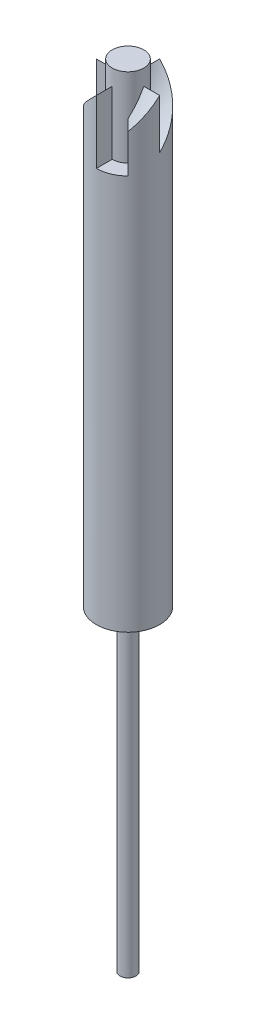
ISO-10303-21;
HEADER;
FILE_DESCRIPTION(('STEP AP214'),'2;1');
FILE_NAME('part.step','',(''),(''),'','','');
FILE_SCHEMA(('AUTOMOTIVE_DESIGN { 1 0 10303 214 1 1 1 1 }'));
ENDSEC;
DATA;
#1=APPLICATION_CONTEXT('core data for automotive mechanical design processes');
#2=APPLICATION_PROTOCOL_DEFINITION('international standard','automotive_design',2000,#1);
#3=PRODUCT_CONTEXT('',#1,'mechanical');
#4=PRODUCT('Part','Part','',(#3));
#5=PRODUCT_RELATED_PRODUCT_CATEGORY('part','',(#4));
#6=PRODUCT_DEFINITION_FORMATION('','',#4);
#7=PRODUCT_DEFINITION_CONTEXT('part definition',#1,'design');
#8=PRODUCT_DEFINITION('design','',#6,#7);
#9=PRODUCT_DEFINITION_SHAPE('','',#8);
#10=(LENGTH_UNIT() NAMED_UNIT(*) SI_UNIT(.MILLI.,.METRE.));
#11=(NAMED_UNIT(*) PLANE_ANGLE_UNIT() SI_UNIT($,.RADIAN.));
#12=(NAMED_UNIT(*) SI_UNIT($,.STERADIAN.) SOLID_ANGLE_UNIT());
#13=UNCERTAINTY_MEASURE_WITH_UNIT(LENGTH_MEASURE(1.E-05),#10,'distance_accuracy_value','');
#14=(GEOMETRIC_REPRESENTATION_CONTEXT(3) GLOBAL_UNCERTAINTY_ASSIGNED_CONTEXT((#13)) GLOBAL_UNIT_ASSIGNED_CONTEXT((#10,
#11,#12)) REPRESENTATION_CONTEXT('',''));
#15=CARTESIAN_POINT('',(0.,0.,0.));
#16=DIRECTION('',(0.,0.,1.));
#17=DIRECTION('',(1.,0.,0.));
#18=AXIS2_PLACEMENT_3D('',#15,#16,#17);
#19=CARTESIAN_POINT('',(0.,0.,0.));
#20=DIRECTION('',(0.,-1.,0.));
#21=DIRECTION('',(0.,0.,-1.));
#22=AXIS2_PLACEMENT_3D('',#19,#20,#21);
#23=CYLINDRICAL_SURFACE('',#22,25.4);
#24=CARTESIAN_POINT('',(-25.4,368.3,0.));
#25=CARTESIAN_POINT('',(-25.4,363.866863699934,-4.47870530999501));
#26=CARTESIAN_POINT('',(-23.8681925679621,359.433727399869,-8.68731164047199));
#27=CARTESIAN_POINT('',(-22.3363851359242,355.000591099803,-12.895917970949));
#28=CARTESIAN_POINT('',(-19.457528855222,350.567454799738,-16.3268052860381));
#29=CARTESIAN_POINT('',(-16.5786725745199,346.134318499672,-19.7576926011272));
#30=CARTESIAN_POINT('',(-12.7,341.701182199606,-21.9970452561247));
#31=CARTESIAN_POINT('',(-8.82132742548007,337.268045899541,-24.2363979111222));
#32=CARTESIAN_POINT('',(-4.41066371274004,332.834909599475,-25.0141169265101));
#33=CARTESIAN_POINT('',(0.,328.40177329941,-25.7918359418979));
#34=CARTESIAN_POINT('',(4.41066371274002,323.968636999344,-25.0141169265101));
#35=CARTESIAN_POINT('',(8.82132742548006,319.535500699279,-24.2363979111222));
#36=CARTESIAN_POINT('',(12.7,315.102364399213,-21.9970452561247));
#37=(BOUNDED_CURVE() B_SPLINE_CURVE(2,(#24,#25,#26,#27,#28,#29,#30,#31,#32,#33,#34,#35,#36),
.UNSPECIFIED.,.F.,.F.) B_SPLINE_CURVE_WITH_KNOTS((3,2,2,2,2,2,3),(0.,0.166666666666667,
0.333333333333333,0.5,0.666666666666667,0.833333333333333,1.),
.UNSPECIFIED.) CURVE() GEOMETRIC_REPRESENTATION_ITEM() RATIONAL_B_SPLINE_CURVE((1.,
0.984807753012208,1.,0.984807753012208,1.,0.984807753012208,1.,0.984807753012208,1.,
0.984807753012208,1.,0.984807753012208,1.)) REPRESENTATION_ITEM(''));
#38=CARTESIAN_POINT('',(-25.4,368.3,-1.56806494771863E-13));
#39=VERTEX_POINT('',#38);
#40=CARTESIAN_POINT('',(-17.9605122421383,348.359353579942,-17.9605122421383));
#41=VERTEX_POINT('',#40);
#42=EDGE_CURVE('E220',#39,#41,#37,.T.);
#43=ORIENTED_EDGE('',*,*,#42,.T.);
#44=DIRECTION('',(0.,1.,0.));
#45=VECTOR('',#44,1.);
#46=CARTESIAN_POINT('',(-17.9605122421383,317.5,-17.9605122421383));
#47=LINE('',#46,#45);
#48=CARTESIAN_POINT('',(-17.9605122421383,317.5,-17.9605122421383));
#49=VERTEX_POINT('',#48);
#50=EDGE_CURVE('E158',#49,#41,#47,.T.);
#51=ORIENTED_EDGE('',*,*,#50,.F.);
#52=CARTESIAN_POINT('',(0.,317.5,0.));
#53=DIRECTION('',(0.,1.,0.));
#54=DIRECTION('',(0.,0.,-1.));
#55=AXIS2_PLACEMENT_3D('',#52,#53,#54);
#56=CIRCLE('',#55,25.4);
#57=CARTESIAN_POINT('',(0.,317.5,-25.4));
#58=VERTEX_POINT('',#57);
#59=EDGE_CURVE('E149',#58,#49,#56,.T.);
#60=ORIENTED_EDGE('',*,*,#59,.F.);
#61=DIRECTION('',(0.,1.,0.));
#62=VECTOR('',#61,1.);
#63=CARTESIAN_POINT('',(0.,328.40177329941,-25.4));
#64=LINE('',#63,#62);
#65=CARTESIAN_POINT('',(0.,368.3,-25.4));
#66=VERTEX_POINT('',#65);
#67=EDGE_CURVE('E146',#58,#66,#64,.T.);
#68=ORIENTED_EDGE('',*,*,#67,.T.);
#69=CARTESIAN_POINT('',(2.66050878019847E-13,368.3,-25.4));
#70=CARTESIAN_POINT('',(4.47870530999528,363.866863699934,-25.4));
#71=CARTESIAN_POINT('',(8.68731164047224,359.433727399869,-23.868192567962));
#72=CARTESIAN_POINT('',(12.8959179709492,355.000591099803,-22.336385135924));
#73=CARTESIAN_POINT('',(16.3268052860383,350.567454799738,-19.4575288552219));
#74=CARTESIAN_POINT('',(19.7576926011274,346.134318499672,-16.5786725745197));
#75=CARTESIAN_POINT('',(21.9970452561249,341.701182199606,-12.6999999999998));
#76=CARTESIAN_POINT('',(24.2363979111223,337.268045899541,-8.82132742547982));
#77=CARTESIAN_POINT('',(25.0141169265101,332.834909599475,-4.41066371273978));
#78=CARTESIAN_POINT('',(25.7918359418979,328.40177329941,2.63689723628348E-13));
#79=CARTESIAN_POINT('',(25.01411692651,323.968636999344,4.41066371274029));
#80=CARTESIAN_POINT('',(24.2363979111222,319.535500699279,8.82132742548031));
#81=CARTESIAN_POINT('',(21.9970452561246,315.102364399213,12.7000000000002));
#82=(BOUNDED_CURVE() B_SPLINE_CURVE(2,(#69,#70,#71,#72,#73,#74,#75,#76,#77,#78,#79,#80,#81),
.UNSPECIFIED.,.F.,.F.) B_SPLINE_CURVE_WITH_KNOTS((3,2,2,2,2,2,3),(0.,0.166666666666667,
0.333333333333333,0.5,0.666666666666667,0.833333333333333,1.),
.UNSPECIFIED.) CURVE() GEOMETRIC_REPRESENTATION_ITEM() RATIONAL_B_SPLINE_CURVE((1.,
0.984807753012208,1.,0.984807753012208,1.,0.984807753012208,1.,0.984807753012208,1.,
0.984807753012208,1.,0.984807753012208,1.)) REPRESENTATION_ITEM(''));
#83=CARTESIAN_POINT('',(25.4,328.40177329941,3.55124253831915E-13));
#84=VERTEX_POINT('',#83);
#85=EDGE_CURVE('E581',#66,#84,#82,.T.);
#86=ORIENTED_EDGE('',*,*,#85,.T.);
#87=DIRECTION('',(0.,1.,0.));
#88=VECTOR('',#87,1.);
#89=CARTESIAN_POINT('',(25.4,328.40177329941,3.49848380464409E-13));
#90=LINE('',#89,#88);
#91=CARTESIAN_POINT('',(25.4,368.3,3.34152007301787E-13));
#92=VERTEX_POINT('',#91);
#93=EDGE_CURVE('E583',#84,#92,#90,.T.);
#94=ORIENTED_EDGE('',*,*,#93,.T.);
#95=CARTESIAN_POINT('',(25.4,368.3,0.));
#96=CARTESIAN_POINT('',(25.4,363.866863699934,4.47870530999501));
#97=CARTESIAN_POINT('',(23.8681925679621,359.433727399869,8.68731164047199));
#98=CARTESIAN_POINT('',(22.3363851359242,355.000591099803,12.895917970949));
#99=CARTESIAN_POINT('',(19.457528855222,350.567454799738,16.3268052860381));
#100=CARTESIAN_POINT('',(16.5786725745199,346.134318499672,19.7576926011272));
#101=CARTESIAN_POINT('',(12.7,341.701182199606,21.9970452561247));
#102=CARTESIAN_POINT('',(8.82132742548007,337.268045899541,24.2363979111222));
#103=CARTESIAN_POINT('',(4.41066371274004,332.834909599475,25.0141169265101));
#104=CARTESIAN_POINT('',(0.,328.40177329941,25.7918359418979));
#105=CARTESIAN_POINT('',(-4.41066371274002,323.968636999344,25.0141169265101));
#106=CARTESIAN_POINT('',(-8.82132742548006,319.535500699279,24.2363979111222));
#107=CARTESIAN_POINT('',(-12.7,315.102364399213,21.9970452561247));
#108=(BOUNDED_CURVE() B_SPLINE_CURVE(2,(#95,#96,#97,#98,#99,#100,#101,#102,#103,#104,#105,#106,
#107),.UNSPECIFIED.,.F.,.F.) B_SPLINE_CURVE_WITH_KNOTS((3,2,2,2,2,2,3),(0.,0.166666666666667,
0.333333333333333,0.5,0.666666666666667,0.833333333333333,1.),
.UNSPECIFIED.) CURVE() GEOMETRIC_REPRESENTATION_ITEM() RATIONAL_B_SPLINE_CURVE((1.,
0.984807753012208,1.,0.984807753012208,1.,0.984807753012208,1.,0.984807753012208,1.,
0.984807753012208,1.,0.984807753012208,1.)) REPRESENTATION_ITEM(''));
#109=CARTESIAN_POINT('',(17.9605122421383,348.359353579942,17.9605122421383));
#110=VERTEX_POINT('',#109);
#111=EDGE_CURVE('E312',#92,#110,#108,.T.);
#112=ORIENTED_EDGE('',*,*,#111,.T.);
#113=DIRECTION('',(0.,1.,0.));
#114=VECTOR('',#113,1.);
#115=CARTESIAN_POINT('',(17.9605122421383,317.5,17.9605122421383));
#116=LINE('',#115,#114);
#117=CARTESIAN_POINT('',(17.9605122421383,317.5,17.9605122421383));
#118=VERTEX_POINT('',#117);
#119=EDGE_CURVE('E303',#118,#110,#116,.T.);
#120=ORIENTED_EDGE('',*,*,#119,.F.);
#121=CARTESIAN_POINT('',(0.,317.5,0.));
#122=DIRECTION('',(0.,1.,0.));
#123=DIRECTION('',(0.,0.,1.));
#124=AXIS2_PLACEMENT_3D('',#121,#122,#123);
#125=CIRCLE('',#124,25.4);
#126=CARTESIAN_POINT('',(0.,317.5,25.4));
#127=VERTEX_POINT('',#126);
#128=EDGE_CURVE('E298',#127,#118,#125,.T.);
#129=ORIENTED_EDGE('',*,*,#128,.F.);
#130=DIRECTION('',(0.,1.,0.));
#131=VECTOR('',#130,1.);
#132=CARTESIAN_POINT('',(0.,328.40177329941,25.4));
#133=LINE('',#132,#131);
#134=CARTESIAN_POINT('',(0.,368.3,25.4));
#135=VERTEX_POINT('',#134);
#136=EDGE_CURVE('E308',#127,#135,#133,.T.);
#137=ORIENTED_EDGE('',*,*,#136,.T.);
#138=CARTESIAN_POINT('',(0.,368.3,25.4));
#139=CARTESIAN_POINT('',(-4.4787053099951,363.866863699934,25.4));
#140=CARTESIAN_POINT('',(-8.68731164047207,359.433727399869,23.868192567962));
#141=CARTESIAN_POINT('',(-12.895917970949,355.000591099803,22.3363851359241));
#142=CARTESIAN_POINT('',(-16.3268052860382,350.567454799738,19.457528855222));
#143=CARTESIAN_POINT('',(-19.7576926011273,346.134318499672,16.5786725745199));
#144=CARTESIAN_POINT('',(-21.9970452561248,341.701182199606,12.6999999999999));
#145=CARTESIAN_POINT('',(-24.2363979111223,337.268045899541,8.82132742547999));
#146=CARTESIAN_POINT('',(-25.0141169265101,332.834909599475,4.41066371273995));
#147=CARTESIAN_POINT('',(-25.7918359418979,328.40177329941,0.));
#148=CARTESIAN_POINT('',(-25.0141169265101,323.968636999344,-4.41066371274011));
#149=CARTESIAN_POINT('',(-24.2363979111222,319.535500699279,-8.82132742548014));
#150=CARTESIAN_POINT('',(-21.9970452561247,315.102364399213,-12.7000000000001));
#151=(BOUNDED_CURVE() B_SPLINE_CURVE(2,(#138,#139,#140,#141,#142,#143,#144,#145,#146,#147,#148,
#149,#150),.UNSPECIFIED.,.F.,.F.) B_SPLINE_CURVE_WITH_KNOTS((3,2,2,2,2,2,3),(0.,
0.166666666666667,0.333333333333333,0.5,0.666666666666667,0.833333333333333,1.),
.UNSPECIFIED.) CURVE() GEOMETRIC_REPRESENTATION_ITEM() RATIONAL_B_SPLINE_CURVE((1.,
0.984807753012208,1.,0.984807753012208,1.,0.984807753012208,1.,0.984807753012208,1.,
0.984807753012208,1.,0.984807753012208,1.)) REPRESENTATION_ITEM(''));
#152=CARTESIAN_POINT('',(-25.4,328.40177329941,-1.77866141377558E-13));
#153=VERTEX_POINT('',#152);
#154=EDGE_CURVE('E53',#135,#153,#151,.T.);
#155=ORIENTED_EDGE('',*,*,#154,.T.);
#156=DIRECTION('',(0.,1.,0.));
#157=VECTOR('',#156,1.);
#158=CARTESIAN_POINT('',(-25.4,328.40177329941,-1.72481128451178E-13));
#159=LINE('',#158,#157);
#160=EDGE_CURVE('E295',#153,#39,#159,.T.);
#161=ORIENTED_EDGE('',*,*,#160,.T.);
#162=EDGE_LOOP('',(#43,#51,#60,#68,#86,#94,#112,#120,#129,#137,#155,#161));
#163=FACE_BOUND('',#162,.T.);
#164=CARTESIAN_POINT('',(0.,0.,0.));
#165=DIRECTION('',(0.,-1.,0.));
#166=DIRECTION('',(0.,0.,-1.));
#167=AXIS2_PLACEMENT_3D('',#164,#165,#166);
#168=CIRCLE('',#167,25.4);
#169=CARTESIAN_POINT('',(0.,0.,-25.4));
#170=VERTEX_POINT('',#169);
#171=EDGE_CURVE('E343',#170,#170,#168,.T.);
#172=ORIENTED_EDGE('',*,*,#171,.F.);
#173=EDGE_LOOP('',(#172));
#174=FACE_BOUND('',#173,.T.);
#175=ADVANCED_FACE('F33',(#163,#174),#23,.T.);
#176=CARTESIAN_POINT('',(0.,-254.,0.));
#177=DIRECTION('',(0.,1.,0.));
#178=DIRECTION('',(0.,0.,1.));
#179=AXIS2_PLACEMENT_3D('',#176,#177,#178);
#180=PLANE('',#179);
#181=CARTESIAN_POINT('',(0.,-254.,0.));
#182=DIRECTION('',(0.,-1.,0.));
#183=DIRECTION('',(0.,0.,-1.));
#184=AXIS2_PLACEMENT_3D('',#181,#182,#183);
#185=CIRCLE('',#184,6.34999999999999);
#186=CARTESIAN_POINT('',(0.,-254.,-6.34999999999999));
#187=VERTEX_POINT('',#186);
#188=EDGE_CURVE('E349',#187,#187,#185,.T.);
#189=ORIENTED_EDGE('',*,*,#188,.T.);
#190=EDGE_LOOP('',(#189));
#191=FACE_BOUND('',#190,.T.);
#192=ADVANCED_FACE('F35',(#191),#180,.F.);
#193=CARTESIAN_POINT('',(0.,0.,0.));
#194=DIRECTION('',(0.,-1.,0.));
#195=DIRECTION('',(0.,0.,-1.));
#196=AXIS2_PLACEMENT_3D('',#193,#194,#195);
#197=CYLINDRICAL_SURFACE('',#196,6.34999999999999);
#198=ORIENTED_EDGE('',*,*,#188,.F.);
#199=EDGE_LOOP('',(#198));
#200=FACE_BOUND('',#199,.T.);
#201=CARTESIAN_POINT('',(0.,0.,0.));
#202=DIRECTION('',(0.,-1.,0.));
#203=DIRECTION('',(0.,0.,-1.));
#204=AXIS2_PLACEMENT_3D('',#201,#202,#203);
#205=CIRCLE('',#204,6.34999999999999);
#206=CARTESIAN_POINT('',(0.,0.,-6.34999999999999));
#207=VERTEX_POINT('',#206);
#208=EDGE_CURVE('E346',#207,#207,#205,.T.);
#209=ORIENTED_EDGE('',*,*,#208,.T.);
#210=EDGE_LOOP('',(#209));
#211=FACE_BOUND('',#210,.T.);
#212=ADVANCED_FACE('F385',(#200,#211),#197,.T.);
#213=CARTESIAN_POINT('',(-6.34999999999999,0.,0.));
#214=DIRECTION('',(0.,1.,0.));
#215=DIRECTION('',(0.,0.,1.));
#216=AXIS2_PLACEMENT_3D('',#213,#214,#215);
#217=PLANE('',#216);
#218=ORIENTED_EDGE('',*,*,#208,.F.);
#219=EDGE_LOOP('',(#218));
#220=FACE_BOUND('',#219,.T.);
#221=ORIENTED_EDGE('',*,*,#171,.T.);
#222=EDGE_LOOP('',(#221));
#223=FACE_BOUND('',#222,.T.);
#224=ADVANCED_FACE('F391',(#220,#223),#217,.F.);
#225=CARTESIAN_POINT('',(0.,368.3,0.));
#226=DIRECTION('',(0.,1.,0.));
#227=DIRECTION('',(0.,0.,1.));
#228=AXIS2_PLACEMENT_3D('',#225,#226,#227);
#229=CYLINDRICAL_SURFACE('',#228,12.7);
#230=DIRECTION('',(0.,1.,0.));
#231=VECTOR('',#230,1.);
#232=CARTESIAN_POINT('',(-8.98025612106919,317.5,-8.98025612106912));
#233=LINE('',#232,#231);
#234=CARTESIAN_POINT('',(-8.98025612106919,317.5,-8.98025612106912));
#235=VERTEX_POINT('',#234);
#236=CARTESIAN_POINT('',(-8.98025612106919,348.359353579942,-8.98025612106912));
#237=VERTEX_POINT('',#236);
#238=EDGE_CURVE('E159',#235,#237,#233,.T.);
#239=ORIENTED_EDGE('',*,*,#238,.T.);
#240=CARTESIAN_POINT('',(-12.7,368.3,0.));
#241=CARTESIAN_POINT('',(-12.7,363.866863699934,-2.23935265499751));
#242=CARTESIAN_POINT('',(-11.934096283981,359.433727399869,-4.34365582023599));
#243=CARTESIAN_POINT('',(-11.1681925679621,355.000591099803,-6.44795898547448));
#244=CARTESIAN_POINT('',(-9.72876442761103,350.567454799738,-8.16340264301905));
#245=CARTESIAN_POINT('',(-8.28933628725998,346.134318499672,-9.87884630056362));
#246=CARTESIAN_POINT('',(-6.35000000000001,341.701182199606,-10.9985226280624));
#247=CARTESIAN_POINT('',(-4.41066371274004,337.268045899541,-12.1181989555611));
#248=CARTESIAN_POINT('',(-2.20533185637002,332.834909599475,-12.507058463255));
#249=CARTESIAN_POINT('',(0.,328.40177329941,-12.895917970949));
#250=CARTESIAN_POINT('',(2.20533185637001,323.968636999344,-12.507058463255));
#251=CARTESIAN_POINT('',(4.41066371274003,319.535500699279,-12.1181989555611));
#252=CARTESIAN_POINT('',(6.34999999999999,315.102364399213,-10.9985226280624));
#253=(BOUNDED_CURVE() B_SPLINE_CURVE(2,(#240,#241,#242,#243,#244,#245,#246,#247,#248,#249,#250,
#251,#252),.UNSPECIFIED.,.F.,.F.) B_SPLINE_CURVE_WITH_KNOTS((3,2,2,2,2,2,3),(0.,
0.166666666666667,0.333333333333333,0.5,0.666666666666667,0.833333333333333,1.),
.UNSPECIFIED.) CURVE() GEOMETRIC_REPRESENTATION_ITEM() RATIONAL_B_SPLINE_CURVE((1.,
0.984807753012208,1.,0.984807753012208,1.,0.984807753012208,1.,0.984807753012208,1.,
0.984807753012208,1.,0.984807753012208,1.)) REPRESENTATION_ITEM(''));
#254=CARTESIAN_POINT('',(-12.7,368.3,0.));
#255=VERTEX_POINT('',#254);
#256=EDGE_CURVE('E139',#255,#237,#253,.T.);
#257=ORIENTED_EDGE('',*,*,#256,.F.);
#258=DIRECTION('',(0.,-1.,0.));
#259=VECTOR('',#258,1.);
#260=CARTESIAN_POINT('',(-12.7,368.3,0.));
#261=LINE('',#260,#259);
#262=CARTESIAN_POINT('',(-12.7,328.40177329941,0.));
#263=VERTEX_POINT('',#262);
#264=EDGE_CURVE('E533',#255,#263,#261,.T.);
#265=ORIENTED_EDGE('',*,*,#264,.T.);
#266=CARTESIAN_POINT('',(0.,368.3,12.7));
#267=CARTESIAN_POINT('',(-2.23935265499755,363.866863699934,12.7));
#268=CARTESIAN_POINT('',(-4.34365582023604,359.433727399869,11.934096283981));
#269=CARTESIAN_POINT('',(-6.44795898547452,355.000591099803,11.1681925679621));
#270=CARTESIAN_POINT('',(-8.16340264301909,350.567454799738,9.728764427611));
#271=CARTESIAN_POINT('',(-9.87884630056365,346.134318499672,8.28933628725994));
#272=CARTESIAN_POINT('',(-10.9985226280624,341.701182199606,6.34999999999997));
#273=CARTESIAN_POINT('',(-12.1181989555611,337.268045899541,4.41066371274));
#274=CARTESIAN_POINT('',(-12.5070584632551,332.834909599475,2.20533185636998));
#275=CARTESIAN_POINT('',(-12.895917970949,328.40177329941,0.));
#276=CARTESIAN_POINT('',(-12.507058463255,323.968636999344,-2.20533185637005));
#277=CARTESIAN_POINT('',(-12.1181989555611,319.535500699279,-4.41066371274007));
#278=CARTESIAN_POINT('',(-10.9985226280624,315.102364399213,-6.35000000000003));
#279=(BOUNDED_CURVE() B_SPLINE_CURVE(2,(#266,#267,#268,#269,#270,#271,#272,#273,#274,#275,#276,
#277,#278),.UNSPECIFIED.,.F.,.F.) B_SPLINE_CURVE_WITH_KNOTS((3,2,2,2,2,2,3),(0.,
0.166666666666667,0.333333333333333,0.5,0.666666666666667,0.833333333333333,1.),
.UNSPECIFIED.) CURVE() GEOMETRIC_REPRESENTATION_ITEM() RATIONAL_B_SPLINE_CURVE((1.,
0.984807753012208,1.,0.984807753012208,1.,0.984807753012208,1.,0.984807753012208,1.,
0.984807753012208,1.,0.984807753012208,1.)) REPRESENTATION_ITEM(''));
#280=CARTESIAN_POINT('',(0.,368.3,12.7));
#281=VERTEX_POINT('',#280);
#282=EDGE_CURVE('E535',#281,#263,#279,.T.);
#283=ORIENTED_EDGE('',*,*,#282,.F.);
#284=DIRECTION('',(0.,-1.,0.));
#285=VECTOR('',#284,1.);
#286=CARTESIAN_POINT('',(0.,368.3,12.7));
#287=LINE('',#286,#285);
#288=CARTESIAN_POINT('',(0.,317.5,12.7));
#289=VERTEX_POINT('',#288);
#290=EDGE_CURVE('E328',#281,#289,#287,.T.);
#291=ORIENTED_EDGE('',*,*,#290,.T.);
#292=CARTESIAN_POINT('',(0.,317.5,0.));
#293=DIRECTION('',(0.,-1.,0.));
#294=DIRECTION('',(0.,0.,1.));
#295=AXIS2_PLACEMENT_3D('',#292,#293,#294);
#296=CIRCLE('',#295,12.7);
#297=CARTESIAN_POINT('',(8.98025612106919,317.5,8.98025612106912));
#298=VERTEX_POINT('',#297);
#299=EDGE_CURVE('E286',#298,#289,#296,.T.);
#300=ORIENTED_EDGE('',*,*,#299,.F.);
#301=DIRECTION('',(0.,1.,0.));
#302=VECTOR('',#301,1.);
#303=CARTESIAN_POINT('',(8.98025612106919,317.5,8.98025612106912));
#304=LINE('',#303,#302);
#305=CARTESIAN_POINT('',(8.98025612106919,348.359353579942,8.98025612106912));
#306=VERTEX_POINT('',#305);
#307=EDGE_CURVE('E304',#298,#306,#304,.T.);
#308=ORIENTED_EDGE('',*,*,#307,.T.);
#309=CARTESIAN_POINT('',(12.7,368.3,0.));
#310=CARTESIAN_POINT('',(12.7,363.866863699934,2.23935265499751));
#311=CARTESIAN_POINT('',(11.934096283981,359.433727399869,4.34365582023599));
#312=CARTESIAN_POINT('',(11.1681925679621,355.000591099803,6.44795898547448));
#313=CARTESIAN_POINT('',(9.72876442761103,350.567454799738,8.16340264301905));
#314=CARTESIAN_POINT('',(8.28933628725998,346.134318499672,9.87884630056362));
#315=CARTESIAN_POINT('',(6.35000000000001,341.701182199606,10.9985226280624));
#316=CARTESIAN_POINT('',(4.41066371274004,337.268045899541,12.1181989555611));
#317=CARTESIAN_POINT('',(2.20533185637002,332.834909599475,12.507058463255));
#318=CARTESIAN_POINT('',(0.,328.40177329941,12.895917970949));
#319=CARTESIAN_POINT('',(-2.20533185637001,323.968636999344,12.507058463255));
#320=CARTESIAN_POINT('',(-4.41066371274003,319.535500699279,12.1181989555611));
#321=CARTESIAN_POINT('',(-6.34999999999999,315.102364399213,10.9985226280624));
#322=(BOUNDED_CURVE() B_SPLINE_CURVE(2,(#309,#310,#311,#312,#313,#314,#315,#316,#317,#318,#319,
#320,#321),.UNSPECIFIED.,.F.,.F.) B_SPLINE_CURVE_WITH_KNOTS((3,2,2,2,2,2,3),(0.,
0.166666666666667,0.333333333333333,0.5,0.666666666666667,0.833333333333333,1.),
.UNSPECIFIED.) CURVE() GEOMETRIC_REPRESENTATION_ITEM() RATIONAL_B_SPLINE_CURVE((1.,
0.984807753012208,1.,0.984807753012208,1.,0.984807753012208,1.,0.984807753012208,1.,
0.984807753012208,1.,0.984807753012208,1.)) REPRESENTATION_ITEM(''));
#323=CARTESIAN_POINT('',(12.7,368.3,1.68736605086652E-13));
#324=VERTEX_POINT('',#323);
#325=EDGE_CURVE('E317',#324,#306,#322,.T.);
#326=ORIENTED_EDGE('',*,*,#325,.F.);
#327=DIRECTION('',(0.,-1.,0.));
#328=VECTOR('',#327,1.);
#329=CARTESIAN_POINT('',(12.7,368.3,1.77367252013231E-13));
#330=LINE('',#329,#328);
#331=CARTESIAN_POINT('',(12.7,328.40177329941,1.81624344626905E-13));
#332=VERTEX_POINT('',#331);
#333=EDGE_CURVE('E161',#324,#332,#330,.T.);
#334=ORIENTED_EDGE('',*,*,#333,.T.);
#335=CARTESIAN_POINT('',(1.33025439009923E-13,368.3,-12.7));
#336=CARTESIAN_POINT('',(2.23935265499764,363.866863699934,-12.7));
#337=CARTESIAN_POINT('',(4.34365582023612,359.433727399869,-11.934096283981));
#338=CARTESIAN_POINT('',(6.4479589854746,355.000591099803,-11.168192567962));
#339=CARTESIAN_POINT('',(8.16340264301916,350.567454799738,-9.72876442761094));
#340=CARTESIAN_POINT('',(9.87884630056371,346.134318499672,-8.28933628725987));
#341=CARTESIAN_POINT('',(10.9985226280624,341.701182199606,-6.34999999999989));
#342=CARTESIAN_POINT('',(12.1181989555612,337.268045899541,-4.41066371273991));
#343=CARTESIAN_POINT('',(12.5070584632551,332.834909599475,-2.20533185636989));
#344=CARTESIAN_POINT('',(12.895917970949,328.40177329941,1.29401800033148E-13));
#345=CARTESIAN_POINT('',(12.507058463255,323.968636999344,2.20533185637014));
#346=CARTESIAN_POINT('',(12.1181989555611,319.535500699279,4.41066371274015));
#347=CARTESIAN_POINT('',(10.9985226280623,315.102364399213,6.35000000000011));
#348=(BOUNDED_CURVE() B_SPLINE_CURVE(2,(#335,#336,#337,#338,#339,#340,#341,#342,#343,#344,#345,
#346,#347),.UNSPECIFIED.,.F.,.F.) B_SPLINE_CURVE_WITH_KNOTS((3,2,2,2,2,2,3),(0.,
0.166666666666667,0.333333333333333,0.5,0.666666666666667,0.833333333333333,1.),
.UNSPECIFIED.) CURVE() GEOMETRIC_REPRESENTATION_ITEM() RATIONAL_B_SPLINE_CURVE((1.,
0.984807753012208,1.,0.984807753012208,1.,0.984807753012208,1.,0.984807753012208,1.,
0.984807753012208,1.,0.984807753012208,1.)) REPRESENTATION_ITEM(''));
#349=CARTESIAN_POINT('',(1.33025439009923E-13,368.3,-12.7));
#350=VERTEX_POINT('',#349);
#351=EDGE_CURVE('E136',#350,#332,#348,.T.);
#352=ORIENTED_EDGE('',*,*,#351,.F.);
#353=DIRECTION('',(0.,-1.,0.));
#354=VECTOR('',#353,1.);
#355=CARTESIAN_POINT('',(0.,368.3,-12.7));
#356=LINE('',#355,#354);
#357=CARTESIAN_POINT('',(0.,317.5,-12.7));
#358=VERTEX_POINT('',#357);
#359=EDGE_CURVE('E127',#350,#358,#356,.T.);
#360=ORIENTED_EDGE('',*,*,#359,.T.);
#361=CARTESIAN_POINT('',(0.,317.5,0.));
#362=DIRECTION('',(0.,-1.,0.));
#363=DIRECTION('',(0.,0.,-1.));
#364=AXIS2_PLACEMENT_3D('',#361,#362,#363);
#365=CIRCLE('',#364,12.7);
#366=EDGE_CURVE('E133',#235,#358,#365,.T.);
#367=ORIENTED_EDGE('',*,*,#366,.F.);
#368=EDGE_LOOP('',(#239,#257,#265,#283,#291,#300,#308,#326,#334,#352,#360,#367));
#369=FACE_BOUND('',#368,.T.);
#370=CARTESIAN_POINT('',(0.,381.,0.));
#371=DIRECTION('',(0.,1.,0.));
#372=DIRECTION('',(0.,0.,1.));
#373=AXIS2_PLACEMENT_3D('',#370,#371,#372);
#374=CIRCLE('',#373,12.7);
#375=CARTESIAN_POINT('',(0.,381.,12.7));
#376=VERTEX_POINT('',#375);
#377=EDGE_CURVE('E311',#376,#376,#374,.T.);
#378=ORIENTED_EDGE('',*,*,#377,.F.);
#379=EDGE_LOOP('',(#378));
#380=FACE_BOUND('',#379,.T.);
#381=ADVANCED_FACE('F130',(#369,#380),#229,.T.);
#382=CARTESIAN_POINT('',(-25.4,381.,0.));
#383=DIRECTION('',(0.,-1.,0.));
#384=DIRECTION('',(0.,0.,-1.));
#385=AXIS2_PLACEMENT_3D('',#382,#383,#384);
#386=PLANE('',#385);
#387=ORIENTED_EDGE('',*,*,#377,.T.);
#388=EDGE_LOOP('',(#387));
#389=FACE_BOUND('',#388,.T.);
#390=ADVANCED_FACE('F376',(#389),#386,.F.);
#391=CARTESIAN_POINT('',(0.,368.3,12.7));
#392=DIRECTION('',(-1.,0.,0.));
#393=DIRECTION('',(0.,0.,1.));
#394=AXIS2_PLACEMENT_3D('',#391,#392,#393);
#395=PLANE('',#394);
#396=DIRECTION('',(0.,0.,-1.));
#397=VECTOR('',#396,1.);
#398=CARTESIAN_POINT('',(0.,368.3,25.4));
#399=LINE('',#398,#397);
#400=EDGE_CURVE('E338',#135,#281,#399,.T.);
#401=ORIENTED_EDGE('',*,*,#400,.F.);
#402=ORIENTED_EDGE('',*,*,#136,.F.);
#403=DIRECTION('',(0.,0.,1.));
#404=VECTOR('',#403,1.);
#405=CARTESIAN_POINT('',(0.,317.5,12.7));
#406=LINE('',#405,#404);
#407=EDGE_CURVE('E294',#289,#127,#406,.T.);
#408=ORIENTED_EDGE('',*,*,#407,.F.);
#409=ORIENTED_EDGE('',*,*,#290,.F.);
#410=EDGE_LOOP('',(#401,#402,#408,#409));
#411=FACE_BOUND('',#410,.T.);
#412=ADVANCED_FACE('F369',(#411),#395,.F.);
#413=CARTESIAN_POINT('',(12.7,368.3,0.));
#414=CARTESIAN_POINT('',(12.7,363.866863699934,2.23935265499751));
#415=CARTESIAN_POINT('',(11.934096283981,359.433727399869,4.34365582023599));
#416=CARTESIAN_POINT('',(11.1681925679621,355.000591099803,6.44795898547448));
#417=CARTESIAN_POINT('',(9.72876442761103,350.567454799738,8.16340264301905));
#418=CARTESIAN_POINT('',(8.28933628725998,346.134318499672,9.87884630056362));
#419=CARTESIAN_POINT('',(6.35000000000001,341.701182199606,10.9985226280624));
#420=CARTESIAN_POINT('',(4.41066371274004,337.268045899541,12.1181989555611));
#421=CARTESIAN_POINT('',(2.20533185637002,332.834909599475,12.507058463255));
#422=CARTESIAN_POINT('',(0.,328.40177329941,12.895917970949));
#423=CARTESIAN_POINT('',(-2.20533185637001,323.968636999344,12.507058463255));
#424=CARTESIAN_POINT('',(-4.41066371274003,319.535500699279,12.1181989555611));
#425=CARTESIAN_POINT('',(-6.34999999999999,315.102364399213,10.9985226280624));
#426=CARTESIAN_POINT('',(25.4,368.3,0.));
#427=CARTESIAN_POINT('',(25.4,363.866863699934,4.47870530999501));
#428=CARTESIAN_POINT('',(23.8681925679621,359.433727399869,8.68731164047199));
#429=CARTESIAN_POINT('',(22.3363851359242,355.000591099803,12.895917970949));
#430=CARTESIAN_POINT('',(19.457528855222,350.567454799738,16.3268052860381));
#431=CARTESIAN_POINT('',(16.5786725745199,346.134318499672,19.7576926011272));
#432=CARTESIAN_POINT('',(12.7,341.701182199606,21.9970452561247));
#433=CARTESIAN_POINT('',(8.82132742548007,337.268045899541,24.2363979111222));
#434=CARTESIAN_POINT('',(4.41066371274004,332.834909599475,25.0141169265101));
#435=CARTESIAN_POINT('',(0.,328.40177329941,25.7918359418979));
#436=CARTESIAN_POINT('',(-4.41066371274002,323.968636999344,25.0141169265101));
#437=CARTESIAN_POINT('',(-8.82132742548006,319.535500699279,24.2363979111222));
#438=CARTESIAN_POINT('',(-12.7,315.102364399213,21.9970452561247));
#439=(BOUNDED_SURFACE() B_SPLINE_SURFACE(1,2,((#413,#414,#415,#416,#417,#418,#419,#420,#421,
#422,#423,#424,#425),(#426,#427,#428,#429,#430,#431,#432,#433,#434,#435,#436,#437,#438)),
.UNSPECIFIED.,.F.,.F.,.F.) B_SPLINE_SURFACE_WITH_KNOTS((2,2),(3,2,2,2,2,2,3),(0.,1.),(0.,
0.166666666666667,0.333333333333333,0.5,0.666666666666667,0.833333333333333,1.),
.UNSPECIFIED.) GEOMETRIC_REPRESENTATION_ITEM() RATIONAL_B_SPLINE_SURFACE(((1.,0.984807753012208,
1.,0.984807753012208,1.,0.984807753012208,1.,0.984807753012208,1.,0.984807753012208,1.,
0.984807753012208,1.),(1.,0.984807753012208,1.,0.984807753012208,1.,0.984807753012208,1.,
0.984807753012208,1.,0.984807753012208,1.,0.984807753012208,1.))) REPRESENTATION_ITEM('') SURFACE());
#440=CARTESIAN_POINT('',(8.98025612106919,348.359353579942,8.98025612106912));
#441=CARTESIAN_POINT('',(9.74015537497615,348.359353579942,9.74015537497608));
#442=CARTESIAN_POINT('',(10.5000546288831,348.359353579942,10.500054628883));
#443=CARTESIAN_POINT('',(12.019853136697,348.359353579942,12.019853136697));
#444=CARTESIAN_POINT('',(12.779752390604,348.359353579942,12.7797523906039));
#445=CARTESIAN_POINT('',(15.0132718437201,348.359353579942,15.01327184372));
#446=CARTESIAN_POINT('',(16.4868920429292,348.359353579942,16.4868920429291));
#447=CARTESIAN_POINT('',(17.9605122421383,348.359353579942,17.9605122421383));
#448=B_SPLINE_CURVE_WITH_KNOTS('',3,(#440,#441,#442,#443,#444,#445,#446,#447),.UNSPECIFIED.,.F.,
.F.,(4,2,2,4),(0.,3.22397949273724,6.44795898547447,12.7),.UNSPECIFIED.);
#449=EDGE_CURVE('E46',#306,#110,#448,.T.);
#450=CARTESIAN_POINT('',(25.4,368.3,0.));
#451=CARTESIAN_POINT('',(12.7,368.3,0.));
#452=(BOUNDED_CURVE() B_SPLINE_CURVE(1,(#450,#451),.UNSPECIFIED.,.F.,
.F.) B_SPLINE_CURVE_WITH_KNOTS((2,2),(0.,1.),
.UNSPECIFIED.) CURVE() GEOMETRIC_REPRESENTATION_ITEM() RATIONAL_B_SPLINE_CURVE((1.,1.)) REPRESENTATION_ITEM(''));
#453=EDGE_CURVE('E306',#324,#92,#452,.F.);
#454=ORIENTED_EDGE('',*,*,#325,.T.);
#455=ORIENTED_EDGE('',*,*,#449,.T.);
#456=ORIENTED_EDGE('',*,*,#111,.F.);
#457=ORIENTED_EDGE('',*,*,#453,.F.);
#458=EDGE_LOOP('',(#454,#455,#456,#457));
#459=FACE_BOUND('',#458,.T.);
#460=ADVANCED_FACE('F361',(#459),#439,.F.);
#461=CARTESIAN_POINT('',(8.98025612106919,317.5,8.98025612106912));
#462=DIRECTION('',(0.707106781186549,0.,-0.707106781186546));
#463=DIRECTION('',(-0.707106781186546,0.,-0.707106781186549));
#464=AXIS2_PLACEMENT_3D('',#461,#462,#463);
#465=PLANE('',#464);
#466=ORIENTED_EDGE('',*,*,#307,.F.);
#467=DIRECTION('',(-0.707106781186546,0.,-0.707106781186549));
#468=VECTOR('',#467,1.);
#469=CARTESIAN_POINT('',(8.98025612106919,317.5,8.98025612106912));
#470=LINE('',#469,#468);
#471=EDGE_CURVE('E300',#118,#298,#470,.T.);
#472=ORIENTED_EDGE('',*,*,#471,.F.);
#473=ORIENTED_EDGE('',*,*,#119,.T.);
#474=ORIENTED_EDGE('',*,*,#449,.F.);
#475=EDGE_LOOP('',(#466,#472,#473,#474));
#476=FACE_BOUND('',#475,.T.);
#477=ADVANCED_FACE('F366',(#476),#465,.F.);
#478=CARTESIAN_POINT('',(0.,317.5,0.));
#479=DIRECTION('',(0.,1.,0.));
#480=DIRECTION('',(0.,0.,1.));
#481=AXIS2_PLACEMENT_3D('',#478,#479,#480);
#482=PLANE('',#481);
#483=ORIENTED_EDGE('',*,*,#299,.T.);
#484=ORIENTED_EDGE('',*,*,#407,.T.);
#485=ORIENTED_EDGE('',*,*,#128,.T.);
#486=ORIENTED_EDGE('',*,*,#471,.T.);
#487=EDGE_LOOP('',(#483,#484,#485,#486));
#488=FACE_BOUND('',#487,.T.);
#489=ADVANCED_FACE('F268',(#488),#482,.T.);
#490=CARTESIAN_POINT('',(-12.7,368.3,0.));
#491=DIRECTION('',(0.,0.,-1.));
#492=DIRECTION('',(-1.,0.,0.));
#493=AXIS2_PLACEMENT_3D('',#490,#491,#492);
#494=PLANE('',#493);
#495=DIRECTION('',(1.,0.,0.));
#496=VECTOR('',#495,1.);
#497=CARTESIAN_POINT('',(-25.4,368.3,-1.77367252013231E-13));
#498=LINE('',#497,#496);
#499=EDGE_CURVE('E219',#39,#255,#498,.T.);
#500=ORIENTED_EDGE('',*,*,#499,.F.);
#501=ORIENTED_EDGE('',*,*,#160,.F.);
#502=DIRECTION('',(-1.,0.,0.));
#503=VECTOR('',#502,1.);
#504=CARTESIAN_POINT('',(-12.7,328.40177329941,0.));
#505=LINE('',#504,#503);
#506=EDGE_CURVE('E248',#263,#153,#505,.T.);
#507=ORIENTED_EDGE('',*,*,#506,.F.);
#508=ORIENTED_EDGE('',*,*,#264,.F.);
#509=EDGE_LOOP('',(#500,#501,#507,#508));
#510=FACE_BOUND('',#509,.T.);
#511=ADVANCED_FACE('F267',(#510),#494,.F.);
#512=CARTESIAN_POINT('',(0.,368.3,12.7));
#513=CARTESIAN_POINT('',(-2.23935265499755,363.866863699934,12.7));
#514=CARTESIAN_POINT('',(-4.34365582023604,359.433727399869,11.934096283981));
#515=CARTESIAN_POINT('',(-6.44795898547452,355.000591099803,11.1681925679621));
#516=CARTESIAN_POINT('',(-8.16340264301909,350.567454799738,9.728764427611));
#517=CARTESIAN_POINT('',(-9.87884630056365,346.134318499672,8.28933628725994));
#518=CARTESIAN_POINT('',(-10.9985226280624,341.701182199606,6.34999999999997));
#519=CARTESIAN_POINT('',(-12.1181989555611,337.268045899541,4.41066371274));
#520=CARTESIAN_POINT('',(-12.5070584632551,332.834909599475,2.20533185636998));
#521=CARTESIAN_POINT('',(-12.895917970949,328.40177329941,0.));
#522=CARTESIAN_POINT('',(-12.507058463255,323.968636999344,-2.20533185637005));
#523=CARTESIAN_POINT('',(-12.1181989555611,319.535500699279,-4.41066371274007));
#524=CARTESIAN_POINT('',(-10.9985226280624,315.102364399213,-6.35000000000003));
#525=CARTESIAN_POINT('',(0.,368.3,25.4));
#526=CARTESIAN_POINT('',(-4.4787053099951,363.866863699934,25.4));
#527=CARTESIAN_POINT('',(-8.68731164047207,359.433727399869,23.868192567962));
#528=CARTESIAN_POINT('',(-12.895917970949,355.000591099803,22.3363851359241));
#529=CARTESIAN_POINT('',(-16.3268052860382,350.567454799738,19.457528855222));
#530=CARTESIAN_POINT('',(-19.7576926011273,346.134318499672,16.5786725745199));
#531=CARTESIAN_POINT('',(-21.9970452561248,341.701182199606,12.6999999999999));
#532=CARTESIAN_POINT('',(-24.2363979111223,337.268045899541,8.82132742547999));
#533=CARTESIAN_POINT('',(-25.0141169265101,332.834909599475,4.41066371273995));
#534=CARTESIAN_POINT('',(-25.7918359418979,328.40177329941,0.));
#535=CARTESIAN_POINT('',(-25.0141169265101,323.968636999344,-4.41066371274011));
#536=CARTESIAN_POINT('',(-24.2363979111222,319.535500699279,-8.82132742548014));
#537=CARTESIAN_POINT('',(-21.9970452561247,315.102364399213,-12.7000000000001));
#538=(BOUNDED_SURFACE() B_SPLINE_SURFACE(1,2,((#512,#513,#514,#515,#516,#517,#518,#519,#520,
#521,#522,#523,#524),(#525,#526,#527,#528,#529,#530,#531,#532,#533,#534,#535,#536,#537)),
.UNSPECIFIED.,.F.,.F.,.F.) B_SPLINE_SURFACE_WITH_KNOTS((2,2),(3,2,2,2,2,2,3),(0.,1.),(0.,
0.166666666666667,0.333333333333333,0.5,0.666666666666667,0.833333333333333,1.),
.UNSPECIFIED.) GEOMETRIC_REPRESENTATION_ITEM() RATIONAL_B_SPLINE_SURFACE(((1.,0.984807753012208,
1.,0.984807753012208,1.,0.984807753012208,1.,0.984807753012208,1.,0.984807753012208,1.,
0.984807753012208,1.),(1.,0.984807753012208,1.,0.984807753012208,1.,0.984807753012208,1.,
0.984807753012208,1.,0.984807753012208,1.,0.984807753012208,1.))) REPRESENTATION_ITEM('') SURFACE());
#539=ORIENTED_EDGE('',*,*,#154,.F.);
#540=ORIENTED_EDGE('',*,*,#400,.T.);
#541=ORIENTED_EDGE('',*,*,#282,.T.);
#542=ORIENTED_EDGE('',*,*,#506,.T.);
#543=EDGE_LOOP('',(#539,#540,#541,#542));
#544=FACE_BOUND('',#543,.T.);
#545=ADVANCED_FACE('F256',(#544),#538,.F.);
#546=CARTESIAN_POINT('',(0.,368.3,-12.7));
#547=DIRECTION('',(1.,0.,0.));
#548=DIRECTION('',(0.,0.,-1.));
#549=AXIS2_PLACEMENT_3D('',#546,#547,#548);
#550=PLANE('',#549);
#551=DIRECTION('',(0.,0.,1.));
#552=VECTOR('',#551,1.);
#553=CARTESIAN_POINT('',(0.,368.3,-25.4));
#554=LINE('',#553,#552);
#555=EDGE_CURVE('E140',#66,#350,#554,.T.);
#556=ORIENTED_EDGE('',*,*,#555,.F.);
#557=ORIENTED_EDGE('',*,*,#67,.F.);
#558=DIRECTION('',(0.,0.,-1.));
#559=VECTOR('',#558,1.);
#560=CARTESIAN_POINT('',(0.,317.5,-12.7));
#561=LINE('',#560,#559);
#562=EDGE_CURVE('E143',#358,#58,#561,.T.);
#563=ORIENTED_EDGE('',*,*,#562,.F.);
#564=ORIENTED_EDGE('',*,*,#359,.F.);
#565=EDGE_LOOP('',(#556,#557,#563,#564));
#566=FACE_BOUND('',#565,.T.);
#567=ADVANCED_FACE('F144',(#566),#550,.F.);
#568=CARTESIAN_POINT('',(-12.7,368.3,0.));
#569=CARTESIAN_POINT('',(-12.7,363.866863699934,-2.23935265499751));
#570=CARTESIAN_POINT('',(-11.934096283981,359.433727399869,-4.34365582023599));
#571=CARTESIAN_POINT('',(-11.1681925679621,355.000591099803,-6.44795898547448));
#572=CARTESIAN_POINT('',(-9.72876442761103,350.567454799738,-8.16340264301905));
#573=CARTESIAN_POINT('',(-8.28933628725998,346.134318499672,-9.87884630056362));
#574=CARTESIAN_POINT('',(-6.35000000000001,341.701182199606,-10.9985226280624));
#575=CARTESIAN_POINT('',(-4.41066371274004,337.268045899541,-12.1181989555611));
#576=CARTESIAN_POINT('',(-2.20533185637002,332.834909599475,-12.507058463255));
#577=CARTESIAN_POINT('',(0.,328.40177329941,-12.895917970949));
#578=CARTESIAN_POINT('',(2.20533185637001,323.968636999344,-12.507058463255));
#579=CARTESIAN_POINT('',(4.41066371274003,319.535500699279,-12.1181989555611));
#580=CARTESIAN_POINT('',(6.34999999999999,315.102364399213,-10.9985226280624));
#581=CARTESIAN_POINT('',(-25.4,368.3,0.));
#582=CARTESIAN_POINT('',(-25.4,363.866863699934,-4.47870530999501));
#583=CARTESIAN_POINT('',(-23.8681925679621,359.433727399869,-8.68731164047199));
#584=CARTESIAN_POINT('',(-22.3363851359242,355.000591099803,-12.895917970949));
#585=CARTESIAN_POINT('',(-19.457528855222,350.567454799738,-16.3268052860381));
#586=CARTESIAN_POINT('',(-16.5786725745199,346.134318499672,-19.7576926011272));
#587=CARTESIAN_POINT('',(-12.7,341.701182199606,-21.9970452561247));
#588=CARTESIAN_POINT('',(-8.82132742548007,337.268045899541,-24.2363979111222));
#589=CARTESIAN_POINT('',(-4.41066371274004,332.834909599475,-25.0141169265101));
#590=CARTESIAN_POINT('',(0.,328.40177329941,-25.7918359418979));
#591=CARTESIAN_POINT('',(4.41066371274002,323.968636999344,-25.0141169265101));
#592=CARTESIAN_POINT('',(8.82132742548006,319.535500699279,-24.2363979111222));
#593=CARTESIAN_POINT('',(12.7,315.102364399213,-21.9970452561247));
#594=(BOUNDED_SURFACE() B_SPLINE_SURFACE(1,2,((#568,#569,#570,#571,#572,#573,#574,#575,#576,
#577,#578,#579,#580),(#581,#582,#583,#584,#585,#586,#587,#588,#589,#590,#591,#592,#593)),
.UNSPECIFIED.,.F.,.F.,.F.) B_SPLINE_SURFACE_WITH_KNOTS((2,2),(3,2,2,2,2,2,3),(0.,1.),(0.,
0.166666666666667,0.333333333333333,0.5,0.666666666666667,0.833333333333333,1.),
.UNSPECIFIED.) GEOMETRIC_REPRESENTATION_ITEM() RATIONAL_B_SPLINE_SURFACE(((1.,0.984807753012208,
1.,0.984807753012208,1.,0.984807753012208,1.,0.984807753012208,1.,0.984807753012208,1.,
0.984807753012208,1.),(1.,0.984807753012208,1.,0.984807753012208,1.,0.984807753012208,1.,
0.984807753012208,1.,0.984807753012208,1.,0.984807753012208,1.))) REPRESENTATION_ITEM('') SURFACE());
#595=CARTESIAN_POINT('',(-8.98025612106919,348.359353579942,-8.98025612106912));
#596=CARTESIAN_POINT('',(-9.74015537497615,348.359353579942,-9.74015537497608));
#597=CARTESIAN_POINT('',(-10.5000546288831,348.359353579942,-10.500054628883));
#598=CARTESIAN_POINT('',(-12.019853136697,348.359353579942,-12.019853136697));
#599=CARTESIAN_POINT('',(-12.779752390604,348.359353579942,-12.7797523906039));
#600=CARTESIAN_POINT('',(-15.0132718437201,348.359353579942,-15.01327184372));
#601=CARTESIAN_POINT('',(-16.4868920429292,348.359353579942,-16.4868920429291));
#602=CARTESIAN_POINT('',(-17.9605122421383,348.359353579942,-17.9605122421383));
#603=B_SPLINE_CURVE_WITH_KNOTS('',3,(#595,#596,#597,#598,#599,#600,#601,#602),.UNSPECIFIED.,.F.,
.F.,(4,2,2,4),(0.,3.22397949273724,6.44795898547447,12.7),.UNSPECIFIED.);
#604=EDGE_CURVE('E11',#237,#41,#603,.T.);
#605=ORIENTED_EDGE('',*,*,#256,.T.);
#606=ORIENTED_EDGE('',*,*,#604,.T.);
#607=ORIENTED_EDGE('',*,*,#42,.F.);
#608=ORIENTED_EDGE('',*,*,#499,.T.);
#609=EDGE_LOOP('',(#605,#606,#607,#608));
#610=FACE_BOUND('',#609,.T.);
#611=ADVANCED_FACE('F197',(#610),#594,.F.);
#612=CARTESIAN_POINT('',(12.7,368.3,1.77367252013231E-13));
#613=DIRECTION('',(0.,0.,1.));
#614=DIRECTION('',(1.,0.,0.));
#615=AXIS2_PLACEMENT_3D('',#612,#613,#614);
#616=PLANE('',#615);
#617=ORIENTED_EDGE('',*,*,#453,.T.);
#618=ORIENTED_EDGE('',*,*,#93,.F.);
#619=DIRECTION('',(1.,0.,0.));
#620=VECTOR('',#619,1.);
#621=CARTESIAN_POINT('',(12.7,328.40177329941,1.72481128451178E-13));
#622=LINE('',#621,#620);
#623=EDGE_CURVE('E166',#332,#84,#622,.T.);
#624=ORIENTED_EDGE('',*,*,#623,.F.);
#625=ORIENTED_EDGE('',*,*,#333,.F.);
#626=EDGE_LOOP('',(#617,#618,#624,#625));
#627=FACE_BOUND('',#626,.T.);
#628=ADVANCED_FACE('F186',(#627),#616,.F.);
#629=CARTESIAN_POINT('',(1.33025439009923E-13,368.3,-12.7));
#630=CARTESIAN_POINT('',(2.23935265499764,363.866863699934,-12.7));
#631=CARTESIAN_POINT('',(4.34365582023612,359.433727399869,-11.934096283981));
#632=CARTESIAN_POINT('',(6.4479589854746,355.000591099803,-11.168192567962));
#633=CARTESIAN_POINT('',(8.16340264301916,350.567454799738,-9.72876442761094));
#634=CARTESIAN_POINT('',(9.87884630056371,346.134318499672,-8.28933628725987));
#635=CARTESIAN_POINT('',(10.9985226280624,341.701182199606,-6.34999999999989));
#636=CARTESIAN_POINT('',(12.1181989555612,337.268045899541,-4.41066371273991));
#637=CARTESIAN_POINT('',(12.5070584632551,332.834909599475,-2.20533185636989));
#638=CARTESIAN_POINT('',(12.895917970949,328.40177329941,1.29401800033148E-13));
#639=CARTESIAN_POINT('',(12.507058463255,323.968636999344,2.20533185637014));
#640=CARTESIAN_POINT('',(12.1181989555611,319.535500699279,4.41066371274015));
#641=CARTESIAN_POINT('',(10.9985226280623,315.102364399213,6.35000000000011));
#642=CARTESIAN_POINT('',(2.66050878019847E-13,368.3,-25.4));
#643=CARTESIAN_POINT('',(4.47870530999528,363.866863699934,-25.4));
#644=CARTESIAN_POINT('',(8.68731164047224,359.433727399869,-23.868192567962));
#645=CARTESIAN_POINT('',(12.8959179709492,355.000591099803,-22.336385135924));
#646=CARTESIAN_POINT('',(16.3268052860383,350.567454799738,-19.4575288552219));
#647=CARTESIAN_POINT('',(19.7576926011274,346.134318499672,-16.5786725745197));
#648=CARTESIAN_POINT('',(21.9970452561249,341.701182199606,-12.6999999999998));
#649=CARTESIAN_POINT('',(24.2363979111223,337.268045899541,-8.82132742547982));
#650=CARTESIAN_POINT('',(25.0141169265101,332.834909599475,-4.41066371273978));
#651=CARTESIAN_POINT('',(25.7918359418979,328.40177329941,2.63689723628348E-13));
#652=CARTESIAN_POINT('',(25.01411692651,323.968636999344,4.41066371274029));
#653=CARTESIAN_POINT('',(24.2363979111222,319.535500699279,8.82132742548031));
#654=CARTESIAN_POINT('',(21.9970452561246,315.102364399213,12.7000000000002));
#655=(BOUNDED_SURFACE() B_SPLINE_SURFACE(1,2,((#629,#630,#631,#632,#633,#634,#635,#636,#637,
#638,#639,#640,#641),(#642,#643,#644,#645,#646,#647,#648,#649,#650,#651,#652,#653,#654)),
.UNSPECIFIED.,.F.,.F.,.F.) B_SPLINE_SURFACE_WITH_KNOTS((2,2),(3,2,2,2,2,2,3),(0.,1.),(0.,
0.166666666666667,0.333333333333333,0.5,0.666666666666667,0.833333333333333,1.),
.UNSPECIFIED.) GEOMETRIC_REPRESENTATION_ITEM() RATIONAL_B_SPLINE_SURFACE(((1.,0.984807753012208,
1.,0.984807753012208,1.,0.984807753012208,1.,0.984807753012208,1.,0.984807753012208,1.,
0.984807753012208,1.),(1.,0.984807753012208,1.,0.984807753012208,1.,0.984807753012208,1.,
0.984807753012208,1.,0.984807753012208,1.,0.984807753012208,1.))) REPRESENTATION_ITEM('') SURFACE());
#656=ORIENTED_EDGE('',*,*,#85,.F.);
#657=ORIENTED_EDGE('',*,*,#555,.T.);
#658=ORIENTED_EDGE('',*,*,#351,.T.);
#659=ORIENTED_EDGE('',*,*,#623,.T.);
#660=EDGE_LOOP('',(#656,#657,#658,#659));
#661=FACE_BOUND('',#660,.T.);
#662=ADVANCED_FACE('F174',(#661),#655,.F.);
#663=CARTESIAN_POINT('',(-8.98025612106919,317.5,-8.98025612106912));
#664=DIRECTION('',(-0.707106781186549,0.,0.707106781186546));
#665=DIRECTION('',(0.707106781186546,0.,0.707106781186549));
#666=AXIS2_PLACEMENT_3D('',#663,#664,#665);
#667=PLANE('',#666);
#668=ORIENTED_EDGE('',*,*,#238,.F.);
#669=DIRECTION('',(0.707106781186546,0.,0.707106781186549));
#670=VECTOR('',#669,1.);
#671=CARTESIAN_POINT('',(-8.98025612106919,317.5,-8.98025612106912));
#672=LINE('',#671,#670);
#673=EDGE_CURVE('E153',#49,#235,#672,.T.);
#674=ORIENTED_EDGE('',*,*,#673,.F.);
#675=ORIENTED_EDGE('',*,*,#50,.T.);
#676=ORIENTED_EDGE('',*,*,#604,.F.);
#677=EDGE_LOOP('',(#668,#674,#675,#676));
#678=FACE_BOUND('',#677,.T.);
#679=ADVANCED_FACE('F185',(#678),#667,.F.);
#680=CARTESIAN_POINT('',(0.,317.5,0.));
#681=DIRECTION('',(0.,1.,0.));
#682=DIRECTION('',(0.,0.,-1.));
#683=AXIS2_PLACEMENT_3D('',#680,#681,#682);
#684=PLANE('',#683);
#685=ORIENTED_EDGE('',*,*,#366,.T.);
#686=ORIENTED_EDGE('',*,*,#562,.T.);
#687=ORIENTED_EDGE('',*,*,#59,.T.);
#688=ORIENTED_EDGE('',*,*,#673,.T.);
#689=EDGE_LOOP('',(#685,#686,#687,#688));
#690=FACE_BOUND('',#689,.T.);
#691=ADVANCED_FACE('F151',(#690),#684,.T.);
#692=CLOSED_SHELL('',(#175,#192,#212,#224,#381,#390,#412,#460,#477,#489,#511,#545,#567,#611,
#628,#662,#679,#691));
#693=MANIFOLD_SOLID_BREP('B2',#692);
#694=ADVANCED_BREP_SHAPE_REPRESENTATION('',(#18,#693),#14);
#695=SHAPE_DEFINITION_REPRESENTATION(#9,#694);
ENDSEC;
END-ISO-10303-21;
